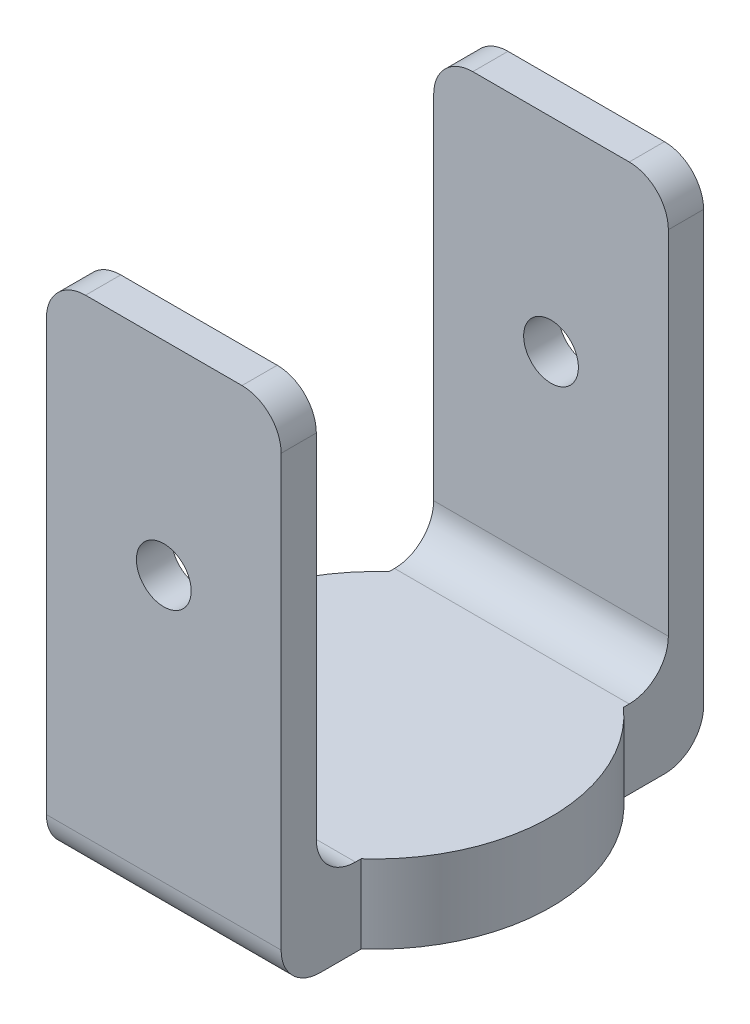
ISO-10303-21;
HEADER;
FILE_DESCRIPTION(('STEP AP214'),'2;1');
FILE_NAME('part.step','',(''),(''),'','','');
FILE_SCHEMA(('AUTOMOTIVE_DESIGN { 1 0 10303 214 1 1 1 1 }'));
ENDSEC;
DATA;
#1=APPLICATION_CONTEXT('core data for automotive mechanical design processes');
#2=APPLICATION_PROTOCOL_DEFINITION('international standard','automotive_design',2000,#1);
#3=PRODUCT_CONTEXT('',#1,'mechanical');
#4=PRODUCT('Part','Part','',(#3));
#5=PRODUCT_RELATED_PRODUCT_CATEGORY('part','',(#4));
#6=PRODUCT_DEFINITION_FORMATION('','',#4);
#7=PRODUCT_DEFINITION_CONTEXT('part definition',#1,'design');
#8=PRODUCT_DEFINITION('design','',#6,#7);
#9=PRODUCT_DEFINITION_SHAPE('','',#8);
#10=(LENGTH_UNIT() NAMED_UNIT(*) SI_UNIT(.MILLI.,.METRE.));
#11=(NAMED_UNIT(*) PLANE_ANGLE_UNIT() SI_UNIT($,.RADIAN.));
#12=(NAMED_UNIT(*) SI_UNIT($,.STERADIAN.) SOLID_ANGLE_UNIT());
#13=UNCERTAINTY_MEASURE_WITH_UNIT(LENGTH_MEASURE(1.E-05),#10,'distance_accuracy_value','');
#14=(GEOMETRIC_REPRESENTATION_CONTEXT(3) GLOBAL_UNCERTAINTY_ASSIGNED_CONTEXT((#13)) GLOBAL_UNIT_ASSIGNED_CONTEXT((#10,
#11,#12)) REPRESENTATION_CONTEXT('',''));
#15=CARTESIAN_POINT('',(0.,0.,0.));
#16=DIRECTION('',(0.,0.,1.));
#17=DIRECTION('',(1.,0.,0.));
#18=AXIS2_PLACEMENT_3D('',#15,#16,#17);
#19=CARTESIAN_POINT('',(30.,0.,0.));
#20=DIRECTION('',(1.,0.,0.));
#21=DIRECTION('',(0.,0.,-1.));
#22=AXIS2_PLACEMENT_3D('',#19,#20,#21);
#23=PLANE('',#22);
#24=DIRECTION('',(0.,1.,0.));
#25=VECTOR('',#24,1.);
#26=CARTESIAN_POINT('',(30.,-55.,-4.5));
#27=LINE('',#26,#25);
#28=CARTESIAN_POINT('',(30.,-50.,-4.5));
#29=VERTEX_POINT('',#28);
#30=CARTESIAN_POINT('',(30.,-5.,-4.5));
#31=VERTEX_POINT('',#30);
#32=EDGE_CURVE('E235',#29,#31,#27,.T.);
#33=ORIENTED_EDGE('',*,*,#32,.T.);
#34=DIRECTION('',(0.,0.,1.));
#35=VECTOR('',#34,1.);
#36=CARTESIAN_POINT('',(30.,-5.,0.));
#37=LINE('',#36,#35);
#38=CARTESIAN_POINT('',(30.,-5.,0.));
#39=VERTEX_POINT('',#38);
#40=EDGE_CURVE('E320',#31,#39,#37,.T.);
#41=ORIENTED_EDGE('',*,*,#40,.T.);
#42=DIRECTION('',(0.,-1.,0.));
#43=VECTOR('',#42,1.);
#44=CARTESIAN_POINT('',(30.,0.,0.));
#45=LINE('',#44,#43);
#46=CARTESIAN_POINT('',(30.,-60.,0.));
#47=VERTEX_POINT('',#46);
#48=EDGE_CURVE('E191',#39,#47,#45,.T.);
#49=ORIENTED_EDGE('',*,*,#48,.T.);
#50=CARTESIAN_POINT('',(30.,-60.,-5.00000000000001));
#51=DIRECTION('',(1.,0.,0.));
#52=DIRECTION('',(0.,0.,-1.));
#53=AXIS2_PLACEMENT_3D('',#50,#51,#52);
#54=CIRCLE('',#53,5.);
#55=CARTESIAN_POINT('',(30.,-65.,-5.00000000000001));
#56=VERTEX_POINT('',#55);
#57=EDGE_CURVE('E317',#47,#56,#54,.T.);
#58=ORIENTED_EDGE('',*,*,#57,.T.);
#59=DIRECTION('',(0.,0.,-1.));
#60=VECTOR('',#59,1.);
#61=CARTESIAN_POINT('',(30.,-65.,0.));
#62=LINE('',#61,#60);
#63=CARTESIAN_POINT('',(30.,-65.,-10.2294901687516));
#64=VERTEX_POINT('',#63);
#65=EDGE_CURVE('E190',#56,#64,#62,.T.);
#66=ORIENTED_EDGE('',*,*,#65,.T.);
#67=DIRECTION('',(0.,-1.,0.));
#68=VECTOR('',#67,1.);
#69=CARTESIAN_POINT('',(30.,-55.,-10.2294901687516));
#70=LINE('',#69,#68);
#71=CARTESIAN_POINT('',(30.,-55.,-10.2294901687516));
#72=VERTEX_POINT('',#71);
#73=EDGE_CURVE('E202',#72,#64,#70,.T.);
#74=ORIENTED_EDGE('',*,*,#73,.F.);
#75=DIRECTION('',(0.,0.,1.));
#76=VECTOR('',#75,1.);
#77=CARTESIAN_POINT('',(30.,-55.,-49.5));
#78=LINE('',#77,#76);
#79=CARTESIAN_POINT('',(30.,-55.,-9.5));
#80=VERTEX_POINT('',#79);
#81=EDGE_CURVE('E232',#72,#80,#78,.T.);
#82=ORIENTED_EDGE('',*,*,#81,.T.);
#83=CARTESIAN_POINT('',(30.,-50.,-9.5));
#84=DIRECTION('',(1.,0.,0.));
#85=DIRECTION('',(0.,0.,-1.));
#86=AXIS2_PLACEMENT_3D('',#83,#84,#85);
#87=CIRCLE('',#86,5.);
#88=EDGE_CURVE('E11',#80,#29,#87,.F.);
#89=ORIENTED_EDGE('',*,*,#88,.T.);
#90=EDGE_LOOP('',(#33,#41,#49,#58,#66,#74,#82,#89));
#91=FACE_BOUND('',#90,.T.);
#92=ADVANCED_FACE('F44',(#91),#23,.T.);
#93=CARTESIAN_POINT('',(0.,0.,0.));
#94=DIRECTION('',(1.,0.,0.));
#95=DIRECTION('',(0.,0.,-1.));
#96=AXIS2_PLACEMENT_3D('',#93,#94,#95);
#97=PLANE('',#96);
#98=DIRECTION('',(0.,-1.,0.));
#99=VECTOR('',#98,1.);
#100=CARTESIAN_POINT('',(0.,0.,0.));
#101=LINE('',#100,#99);
#102=CARTESIAN_POINT('',(0.,-5.,0.));
#103=VERTEX_POINT('',#102);
#104=CARTESIAN_POINT('',(0.,-60.,0.));
#105=VERTEX_POINT('',#104);
#106=EDGE_CURVE('E220',#103,#105,#101,.T.);
#107=ORIENTED_EDGE('',*,*,#106,.F.);
#108=DIRECTION('',(0.,0.,1.));
#109=VECTOR('',#108,1.);
#110=CARTESIAN_POINT('',(0.,-5.,0.));
#111=LINE('',#110,#109);
#112=CARTESIAN_POINT('',(0.,-5.,-4.5));
#113=VERTEX_POINT('',#112);
#114=EDGE_CURVE('E304',#103,#113,#111,.F.);
#115=ORIENTED_EDGE('',*,*,#114,.T.);
#116=DIRECTION('',(0.,1.,0.));
#117=VECTOR('',#116,1.);
#118=CARTESIAN_POINT('',(0.,-55.,-4.5));
#119=LINE('',#118,#117);
#120=CARTESIAN_POINT('',(0.,-50.,-4.5));
#121=VERTEX_POINT('',#120);
#122=EDGE_CURVE('E223',#121,#113,#119,.T.);
#123=ORIENTED_EDGE('',*,*,#122,.F.);
#124=CARTESIAN_POINT('',(0.,-50.,-9.5));
#125=DIRECTION('',(1.,0.,0.));
#126=DIRECTION('',(0.,0.,-1.));
#127=AXIS2_PLACEMENT_3D('',#124,#125,#126);
#128=CIRCLE('',#127,5.);
#129=CARTESIAN_POINT('',(0.,-55.,-9.5));
#130=VERTEX_POINT('',#129);
#131=EDGE_CURVE('E54',#121,#130,#128,.T.);
#132=ORIENTED_EDGE('',*,*,#131,.T.);
#133=DIRECTION('',(0.,0.,1.));
#134=VECTOR('',#133,1.);
#135=CARTESIAN_POINT('',(0.,-55.,-49.5));
#136=LINE('',#135,#134);
#137=CARTESIAN_POINT('',(0.,-55.,-10.2294901687516));
#138=VERTEX_POINT('',#137);
#139=EDGE_CURVE('E255',#138,#130,#136,.T.);
#140=ORIENTED_EDGE('',*,*,#139,.F.);
#141=DIRECTION('',(0.,-1.,0.));
#142=VECTOR('',#141,1.);
#143=CARTESIAN_POINT('',(0.,-55.,-10.2294901687516));
#144=LINE('',#143,#142);
#145=CARTESIAN_POINT('',(0.,-65.,-10.2294901687516));
#146=VERTEX_POINT('',#145);
#147=EDGE_CURVE('E281',#138,#146,#144,.T.);
#148=ORIENTED_EDGE('',*,*,#147,.T.);
#149=DIRECTION('',(0.,0.,-1.));
#150=VECTOR('',#149,1.);
#151=CARTESIAN_POINT('',(0.,-65.,0.));
#152=LINE('',#151,#150);
#153=CARTESIAN_POINT('',(0.,-65.,-5.00000000000001));
#154=VERTEX_POINT('',#153);
#155=EDGE_CURVE('E244',#154,#146,#152,.T.);
#156=ORIENTED_EDGE('',*,*,#155,.F.);
#157=CARTESIAN_POINT('',(0.,-60.,-5.00000000000001));
#158=DIRECTION('',(1.,0.,0.));
#159=DIRECTION('',(0.,0.,-1.));
#160=AXIS2_PLACEMENT_3D('',#157,#158,#159);
#161=CIRCLE('',#160,5.);
#162=EDGE_CURVE('E301',#154,#105,#161,.F.);
#163=ORIENTED_EDGE('',*,*,#162,.T.);
#164=EDGE_LOOP('',(#107,#115,#123,#132,#140,#148,#156,#163));
#165=FACE_BOUND('',#164,.T.);
#166=ADVANCED_FACE('F387',(#165),#97,.F.);
#167=CARTESIAN_POINT('',(30.,0.,-4.5));
#168=DIRECTION('',(0.,-1.,0.));
#169=DIRECTION('',(0.,0.,-1.));
#170=AXIS2_PLACEMENT_3D('',#167,#168,#169);
#171=PLANE('',#170);
#172=DIRECTION('',(-1.,0.,0.));
#173=VECTOR('',#172,1.);
#174=CARTESIAN_POINT('',(30.,0.,-4.5));
#175=LINE('',#174,#173);
#176=CARTESIAN_POINT('',(25.,0.,-4.5));
#177=VERTEX_POINT('',#176);
#178=CARTESIAN_POINT('',(5.,0.,-4.5));
#179=VERTEX_POINT('',#178);
#180=EDGE_CURVE('E239',#177,#179,#175,.T.);
#181=ORIENTED_EDGE('',*,*,#180,.T.);
#182=DIRECTION('',(0.,0.,1.));
#183=VECTOR('',#182,1.);
#184=CARTESIAN_POINT('',(5.,0.,-4.5));
#185=LINE('',#184,#183);
#186=CARTESIAN_POINT('',(5.,0.,0.));
#187=VERTEX_POINT('',#186);
#188=EDGE_CURVE('E288',#179,#187,#185,.T.);
#189=ORIENTED_EDGE('',*,*,#188,.T.);
#190=DIRECTION('',(-1.,0.,0.));
#191=VECTOR('',#190,1.);
#192=CARTESIAN_POINT('',(30.,0.,0.));
#193=LINE('',#192,#191);
#194=CARTESIAN_POINT('',(25.,0.,0.));
#195=VERTEX_POINT('',#194);
#196=EDGE_CURVE('E273',#195,#187,#193,.T.);
#197=ORIENTED_EDGE('',*,*,#196,.F.);
#198=DIRECTION('',(0.,0.,1.));
#199=VECTOR('',#198,1.);
#200=CARTESIAN_POINT('',(25.,0.,-4.5));
#201=LINE('',#200,#199);
#202=EDGE_CURVE('E285',#195,#177,#201,.F.);
#203=ORIENTED_EDGE('',*,*,#202,.T.);
#204=EDGE_LOOP('',(#181,#189,#197,#203));
#205=FACE_BOUND('',#204,.T.);
#206=ADVANCED_FACE('F471',(#205),#171,.F.);
#207=CARTESIAN_POINT('',(30.,0.,0.));
#208=DIRECTION('',(0.,0.,-1.));
#209=DIRECTION('',(0.,1.,0.));
#210=AXIS2_PLACEMENT_3D('',#207,#208,#209);
#211=PLANE('',#210);
#212=CARTESIAN_POINT('',(15.,-26.,0.));
#213=DIRECTION('',(0.,0.,-1.));
#214=DIRECTION('',(0.,1.,0.));
#215=AXIS2_PLACEMENT_3D('',#212,#213,#214);
#216=CIRCLE('',#215,3.5);
#217=CARTESIAN_POINT('',(15.,-22.5,0.));
#218=VERTEX_POINT('',#217);
#219=EDGE_CURVE('E215',#218,#218,#216,.T.);
#220=ORIENTED_EDGE('',*,*,#219,.T.);
#221=EDGE_LOOP('',(#220));
#222=FACE_BOUND('',#221,.T.);
#223=ORIENTED_EDGE('',*,*,#196,.T.);
#224=CARTESIAN_POINT('',(5.,-5.,0.));
#225=DIRECTION('',(0.,0.,-1.));
#226=DIRECTION('',(0.,1.,0.));
#227=AXIS2_PLACEMENT_3D('',#224,#225,#226);
#228=CIRCLE('',#227,5.);
#229=EDGE_CURVE('E298',#187,#103,#228,.F.);
#230=ORIENTED_EDGE('',*,*,#229,.T.);
#231=ORIENTED_EDGE('',*,*,#106,.T.);
#232=DIRECTION('',(-1.,0.,0.));
#233=VECTOR('',#232,1.);
#234=CARTESIAN_POINT('',(30.,-60.,0.));
#235=LINE('',#234,#233);
#236=EDGE_CURVE('E292',#105,#47,#235,.F.);
#237=ORIENTED_EDGE('',*,*,#236,.T.);
#238=ORIENTED_EDGE('',*,*,#48,.F.);
#239=CARTESIAN_POINT('',(25.,-5.,0.));
#240=DIRECTION('',(0.,0.,-1.));
#241=DIRECTION('',(0.,1.,0.));
#242=AXIS2_PLACEMENT_3D('',#239,#240,#241);
#243=CIRCLE('',#242,5.);
#244=EDGE_CURVE('E295',#39,#195,#243,.F.);
#245=ORIENTED_EDGE('',*,*,#244,.T.);
#246=EDGE_LOOP('',(#223,#230,#231,#237,#238,#245));
#247=FACE_BOUND('',#246,.T.);
#248=ADVANCED_FACE('F412',(#222,#247),#211,.F.);
#249=CARTESIAN_POINT('',(30.,-65.,0.));
#250=DIRECTION('',(0.,1.,0.));
#251=DIRECTION('',(0.,0.,1.));
#252=AXIS2_PLACEMENT_3D('',#249,#250,#251);
#253=PLANE('',#252);
#254=CARTESIAN_POINT('',(0.,-65.,-43.7705098312485));
#255=VERTEX_POINT('',#254);
#256=CARTESIAN_POINT('',(0.,-65.,-49.));
#257=VERTEX_POINT('',#256);
#258=EDGE_CURVE('E243',#255,#257,#152,.T.);
#259=ORIENTED_EDGE('',*,*,#258,.T.);
#260=DIRECTION('',(-1.,0.,0.));
#261=VECTOR('',#260,1.);
#262=CARTESIAN_POINT('',(30.,-65.,-49.));
#263=LINE('',#262,#261);
#264=CARTESIAN_POINT('',(30.,-65.,-49.));
#265=VERTEX_POINT('',#264);
#266=EDGE_CURVE('E69',#257,#265,#263,.F.);
#267=ORIENTED_EDGE('',*,*,#266,.T.);
#268=CARTESIAN_POINT('',(30.,-65.,-43.7705098312485));
#269=VERTEX_POINT('',#268);
#270=EDGE_CURVE('E182',#269,#265,#62,.T.);
#271=ORIENTED_EDGE('',*,*,#270,.F.);
#272=CARTESIAN_POINT('',(15.,-65.,-27.));
#273=DIRECTION('',(0.,-1.,0.));
#274=DIRECTION('',(0.,0.,-1.));
#275=AXIS2_PLACEMENT_3D('',#272,#273,#274);
#276=CIRCLE('',#275,22.5);
#277=EDGE_CURVE('E187',#269,#64,#276,.T.);
#278=ORIENTED_EDGE('',*,*,#277,.T.);
#279=ORIENTED_EDGE('',*,*,#65,.F.);
#280=DIRECTION('',(-1.,0.,0.));
#281=VECTOR('',#280,1.);
#282=CARTESIAN_POINT('',(30.,-65.,-5.00000000000001));
#283=LINE('',#282,#281);
#284=EDGE_CURVE('E370',#56,#154,#283,.T.);
#285=ORIENTED_EDGE('',*,*,#284,.T.);
#286=ORIENTED_EDGE('',*,*,#155,.T.);
#287=EDGE_CURVE('E209',#146,#255,#276,.T.);
#288=ORIENTED_EDGE('',*,*,#287,.T.);
#289=EDGE_LOOP('',(#259,#267,#271,#278,#279,#285,#286,#288));
#290=FACE_BOUND('',#289,.T.);
#291=ADVANCED_FACE('F184',(#290),#253,.F.);
#292=CARTESIAN_POINT('',(30.,-65.,-54.));
#293=DIRECTION('',(0.,0.,1.));
#294=DIRECTION('',(1.,0.,0.));
#295=AXIS2_PLACEMENT_3D('',#292,#293,#294);
#296=PLANE('',#295);
#297=CARTESIAN_POINT('',(15.,-26.,-54.));
#298=DIRECTION('',(0.,0.,-1.));
#299=DIRECTION('',(-1.,0.,0.));
#300=AXIS2_PLACEMENT_3D('',#297,#298,#299);
#301=CIRCLE('',#300,3.5);
#302=CARTESIAN_POINT('',(11.5,-26.,-54.));
#303=VERTEX_POINT('',#302);
#304=EDGE_CURVE('E490',#303,#303,#301,.T.);
#305=ORIENTED_EDGE('',*,*,#304,.F.);
#306=EDGE_LOOP('',(#305));
#307=FACE_BOUND('',#306,.T.);
#308=DIRECTION('',(0.,1.,0.));
#309=VECTOR('',#308,1.);
#310=CARTESIAN_POINT('',(0.,-65.,-54.));
#311=LINE('',#310,#309);
#312=CARTESIAN_POINT('',(0.,-60.,-54.));
#313=VERTEX_POINT('',#312);
#314=CARTESIAN_POINT('',(0.,-4.99999999999999,-54.));
#315=VERTEX_POINT('',#314);
#316=EDGE_CURVE('E247',#313,#315,#311,.T.);
#317=ORIENTED_EDGE('',*,*,#316,.T.);
#318=CARTESIAN_POINT('',(5.,-4.99999999999999,-54.));
#319=DIRECTION('',(0.,0.,1.));
#320=DIRECTION('',(1.,0.,0.));
#321=AXIS2_PLACEMENT_3D('',#318,#319,#320);
#322=CIRCLE('',#321,5.);
#323=CARTESIAN_POINT('',(5.,0.,-54.));
#324=VERTEX_POINT('',#323);
#325=EDGE_CURVE('E353',#315,#324,#322,.F.);
#326=ORIENTED_EDGE('',*,*,#325,.T.);
#327=DIRECTION('',(-1.,0.,0.));
#328=VECTOR('',#327,1.);
#329=CARTESIAN_POINT('',(30.,0.,-54.));
#330=LINE('',#329,#328);
#331=CARTESIAN_POINT('',(25.,0.,-54.));
#332=VERTEX_POINT('',#331);
#333=EDGE_CURVE('E269',#332,#324,#330,.T.);
#334=ORIENTED_EDGE('',*,*,#333,.F.);
#335=CARTESIAN_POINT('',(25.,-4.99999999999999,-54.));
#336=DIRECTION('',(0.,0.,1.));
#337=DIRECTION('',(1.,0.,0.));
#338=AXIS2_PLACEMENT_3D('',#335,#336,#337);
#339=CIRCLE('',#338,5.);
#340=CARTESIAN_POINT('',(30.,-4.99999999999999,-54.));
#341=VERTEX_POINT('',#340);
#342=EDGE_CURVE('E350',#332,#341,#339,.F.);
#343=ORIENTED_EDGE('',*,*,#342,.T.);
#344=DIRECTION('',(0.,1.,0.));
#345=VECTOR('',#344,1.);
#346=CARTESIAN_POINT('',(30.,-65.,-54.));
#347=LINE('',#346,#345);
#348=CARTESIAN_POINT('',(30.,-60.,-54.));
#349=VERTEX_POINT('',#348);
#350=EDGE_CURVE('E226',#349,#341,#347,.T.);
#351=ORIENTED_EDGE('',*,*,#350,.F.);
#352=DIRECTION('',(-1.,0.,0.));
#353=VECTOR('',#352,1.);
#354=CARTESIAN_POINT('',(30.,-60.,-54.));
#355=LINE('',#354,#353);
#356=EDGE_CURVE('E346',#349,#313,#355,.T.);
#357=ORIENTED_EDGE('',*,*,#356,.T.);
#358=EDGE_LOOP('',(#317,#326,#334,#343,#351,#357));
#359=FACE_BOUND('',#358,.T.);
#360=ADVANCED_FACE('F431',(#307,#359),#296,.F.);
#361=CARTESIAN_POINT('',(30.,0.,-54.));
#362=DIRECTION('',(0.,-1.,0.));
#363=DIRECTION('',(0.,0.,-1.));
#364=AXIS2_PLACEMENT_3D('',#361,#362,#363);
#365=PLANE('',#364);
#366=ORIENTED_EDGE('',*,*,#333,.T.);
#367=DIRECTION('',(0.,0.,1.));
#368=VECTOR('',#367,1.);
#369=CARTESIAN_POINT('',(5.,0.,-54.));
#370=LINE('',#369,#368);
#371=CARTESIAN_POINT('',(5.,0.,-49.5));
#372=VERTEX_POINT('',#371);
#373=EDGE_CURVE('E327',#324,#372,#370,.T.);
#374=ORIENTED_EDGE('',*,*,#373,.T.);
#375=DIRECTION('',(-1.,0.,0.));
#376=VECTOR('',#375,1.);
#377=CARTESIAN_POINT('',(30.,0.,-49.5));
#378=LINE('',#377,#376);
#379=CARTESIAN_POINT('',(25.,0.,-49.5));
#380=VERTEX_POINT('',#379);
#381=EDGE_CURVE('E265',#380,#372,#378,.T.);
#382=ORIENTED_EDGE('',*,*,#381,.F.);
#383=DIRECTION('',(0.,0.,1.));
#384=VECTOR('',#383,1.);
#385=CARTESIAN_POINT('',(25.,0.,-54.));
#386=LINE('',#385,#384);
#387=EDGE_CURVE('E324',#380,#332,#386,.F.);
#388=ORIENTED_EDGE('',*,*,#387,.T.);
#389=EDGE_LOOP('',(#366,#374,#382,#388));
#390=FACE_BOUND('',#389,.T.);
#391=ADVANCED_FACE('F455',(#390),#365,.F.);
#392=CARTESIAN_POINT('',(30.,0.,-49.5));
#393=DIRECTION('',(0.,0.,-1.));
#394=DIRECTION('',(0.,1.,0.));
#395=AXIS2_PLACEMENT_3D('',#392,#393,#394);
#396=PLANE('',#395);
#397=CARTESIAN_POINT('',(15.,-26.,-49.5));
#398=DIRECTION('',(0.,0.,-1.));
#399=DIRECTION('',(0.,1.,0.));
#400=AXIS2_PLACEMENT_3D('',#397,#398,#399);
#401=CIRCLE('',#400,3.5);
#402=CARTESIAN_POINT('',(15.,-22.5,-49.5));
#403=VERTEX_POINT('',#402);
#404=EDGE_CURVE('E489',#403,#403,#401,.T.);
#405=ORIENTED_EDGE('',*,*,#404,.T.);
#406=EDGE_LOOP('',(#405));
#407=FACE_BOUND('',#406,.T.);
#408=ORIENTED_EDGE('',*,*,#381,.T.);
#409=CARTESIAN_POINT('',(5.,-5.,-49.5));
#410=DIRECTION('',(0.,0.,-1.));
#411=DIRECTION('',(0.,1.,0.));
#412=AXIS2_PLACEMENT_3D('',#409,#410,#411);
#413=CIRCLE('',#412,5.);
#414=CARTESIAN_POINT('',(0.,-5.,-49.5));
#415=VERTEX_POINT('',#414);
#416=EDGE_CURVE('E337',#372,#415,#413,.F.);
#417=ORIENTED_EDGE('',*,*,#416,.T.);
#418=DIRECTION('',(0.,-1.,0.));
#419=VECTOR('',#418,1.);
#420=CARTESIAN_POINT('',(0.,0.,-49.5));
#421=LINE('',#420,#419);
#422=CARTESIAN_POINT('',(0.,-50.,-49.5));
#423=VERTEX_POINT('',#422);
#424=EDGE_CURVE('E251',#415,#423,#421,.T.);
#425=ORIENTED_EDGE('',*,*,#424,.T.);
#426=DIRECTION('',(-1.,0.,0.));
#427=VECTOR('',#426,1.);
#428=CARTESIAN_POINT('',(30.,-50.,-49.5));
#429=LINE('',#428,#427);
#430=CARTESIAN_POINT('',(30.,-50.,-49.5));
#431=VERTEX_POINT('',#430);
#432=EDGE_CURVE('E331',#423,#431,#429,.F.);
#433=ORIENTED_EDGE('',*,*,#432,.T.);
#434=DIRECTION('',(0.,-1.,0.));
#435=VECTOR('',#434,1.);
#436=CARTESIAN_POINT('',(30.,0.,-49.5));
#437=LINE('',#436,#435);
#438=CARTESIAN_POINT('',(30.,-5.,-49.5));
#439=VERTEX_POINT('',#438);
#440=EDGE_CURVE('E229',#439,#431,#437,.T.);
#441=ORIENTED_EDGE('',*,*,#440,.F.);
#442=CARTESIAN_POINT('',(25.,-5.,-49.5));
#443=DIRECTION('',(0.,0.,-1.));
#444=DIRECTION('',(0.,1.,0.));
#445=AXIS2_PLACEMENT_3D('',#442,#443,#444);
#446=CIRCLE('',#445,5.);
#447=EDGE_CURVE('E334',#439,#380,#446,.F.);
#448=ORIENTED_EDGE('',*,*,#447,.T.);
#449=EDGE_LOOP('',(#408,#417,#425,#433,#441,#448));
#450=FACE_BOUND('',#449,.T.);
#451=ADVANCED_FACE('F440',(#407,#450),#396,.F.);
#452=CARTESIAN_POINT('',(30.,-55.,-49.5));
#453=DIRECTION('',(0.,-1.,0.));
#454=DIRECTION('',(0.,0.,-1.));
#455=AXIS2_PLACEMENT_3D('',#452,#453,#454);
#456=PLANE('',#455);
#457=CARTESIAN_POINT('',(30.,-55.,-44.5));
#458=VERTEX_POINT('',#457);
#459=CARTESIAN_POINT('',(30.,-55.,-43.7705098312485));
#460=VERTEX_POINT('',#459);
#461=EDGE_CURVE('E197',#458,#460,#78,.T.);
#462=ORIENTED_EDGE('',*,*,#461,.F.);
#463=DIRECTION('',(-1.,0.,0.));
#464=VECTOR('',#463,1.);
#465=CARTESIAN_POINT('',(0.,-55.,-44.5));
#466=LINE('',#465,#464);
#467=CARTESIAN_POINT('',(0.,-55.,-44.5));
#468=VERTEX_POINT('',#467);
#469=EDGE_CURVE('E366',#458,#468,#466,.T.);
#470=ORIENTED_EDGE('',*,*,#469,.T.);
#471=CARTESIAN_POINT('',(0.,-55.,-43.7705098312485));
#472=VERTEX_POINT('',#471);
#473=EDGE_CURVE('E256',#468,#472,#136,.T.);
#474=ORIENTED_EDGE('',*,*,#473,.T.);
#475=CARTESIAN_POINT('',(15.,-55.,-27.));
#476=DIRECTION('',(0.,-1.,0.));
#477=DIRECTION('',(0.,0.,-1.));
#478=AXIS2_PLACEMENT_3D('',#475,#476,#477);
#479=CIRCLE('',#478,22.5);
#480=EDGE_CURVE('E208',#138,#472,#479,.T.);
#481=ORIENTED_EDGE('',*,*,#480,.F.);
#482=ORIENTED_EDGE('',*,*,#139,.T.);
#483=DIRECTION('',(-1.,0.,0.));
#484=VECTOR('',#483,1.);
#485=CARTESIAN_POINT('',(30.,-55.,-9.5));
#486=LINE('',#485,#484);
#487=EDGE_CURVE('E363',#130,#80,#486,.F.);
#488=ORIENTED_EDGE('',*,*,#487,.T.);
#489=ORIENTED_EDGE('',*,*,#81,.F.);
#490=EDGE_CURVE('E203',#460,#72,#479,.T.);
#491=ORIENTED_EDGE('',*,*,#490,.F.);
#492=EDGE_LOOP('',(#462,#470,#474,#481,#482,#488,#489,#491));
#493=FACE_BOUND('',#492,.T.);
#494=ADVANCED_FACE('F393',(#493),#456,.F.);
#495=CARTESIAN_POINT('',(30.,-55.,-4.5));
#496=DIRECTION('',(0.,0.,1.));
#497=DIRECTION('',(1.,0.,0.));
#498=AXIS2_PLACEMENT_3D('',#495,#496,#497);
#499=PLANE('',#498);
#500=CARTESIAN_POINT('',(15.,-26.,-4.5));
#501=DIRECTION('',(0.,0.,1.));
#502=DIRECTION('',(1.,0.,0.));
#503=AXIS2_PLACEMENT_3D('',#500,#501,#502);
#504=CIRCLE('',#503,3.5);
#505=CARTESIAN_POINT('',(18.5,-26.,-4.5));
#506=VERTEX_POINT('',#505);
#507=EDGE_CURVE('E48',#506,#506,#504,.T.);
#508=ORIENTED_EDGE('',*,*,#507,.T.);
#509=EDGE_LOOP('',(#508));
#510=FACE_BOUND('',#509,.T.);
#511=ORIENTED_EDGE('',*,*,#122,.T.);
#512=CARTESIAN_POINT('',(5.,-5.,-4.5));
#513=DIRECTION('',(0.,0.,1.));
#514=DIRECTION('',(1.,0.,0.));
#515=AXIS2_PLACEMENT_3D('',#512,#513,#514);
#516=CIRCLE('',#515,5.);
#517=EDGE_CURVE('E314',#113,#179,#516,.F.);
#518=ORIENTED_EDGE('',*,*,#517,.T.);
#519=ORIENTED_EDGE('',*,*,#180,.F.);
#520=CARTESIAN_POINT('',(25.,-5.,-4.5));
#521=DIRECTION('',(0.,0.,1.));
#522=DIRECTION('',(1.,0.,0.));
#523=AXIS2_PLACEMENT_3D('',#520,#521,#522);
#524=CIRCLE('',#523,5.);
#525=EDGE_CURVE('E311',#177,#31,#524,.F.);
#526=ORIENTED_EDGE('',*,*,#525,.T.);
#527=ORIENTED_EDGE('',*,*,#32,.F.);
#528=DIRECTION('',(-1.,0.,0.));
#529=VECTOR('',#528,1.);
#530=CARTESIAN_POINT('',(0.,-50.,-4.5));
#531=LINE('',#530,#529);
#532=EDGE_CURVE('E307',#29,#121,#531,.T.);
#533=ORIENTED_EDGE('',*,*,#532,.T.);
#534=EDGE_LOOP('',(#511,#518,#519,#526,#527,#533));
#535=FACE_BOUND('',#534,.T.);
#536=ADVANCED_FACE('F403',(#510,#535),#499,.F.);
#537=ORIENTED_EDGE('',*,*,#350,.T.);
#538=DIRECTION('',(0.,0.,1.));
#539=VECTOR('',#538,1.);
#540=CARTESIAN_POINT('',(30.,-5.,-49.5));
#541=LINE('',#540,#539);
#542=EDGE_CURVE('E359',#341,#439,#541,.T.);
#543=ORIENTED_EDGE('',*,*,#542,.T.);
#544=ORIENTED_EDGE('',*,*,#440,.T.);
#545=CARTESIAN_POINT('',(30.,-50.,-44.5));
#546=DIRECTION('',(1.,0.,0.));
#547=DIRECTION('',(0.,0.,-1.));
#548=AXIS2_PLACEMENT_3D('',#545,#546,#547);
#549=CIRCLE('',#548,5.);
#550=EDGE_CURVE('E61',#431,#458,#549,.F.);
#551=ORIENTED_EDGE('',*,*,#550,.T.);
#552=ORIENTED_EDGE('',*,*,#461,.T.);
#553=DIRECTION('',(0.,-1.,0.));
#554=VECTOR('',#553,1.);
#555=CARTESIAN_POINT('',(30.,-55.,-43.7705098312485));
#556=LINE('',#555,#554);
#557=EDGE_CURVE('E194',#269,#460,#556,.F.);
#558=ORIENTED_EDGE('',*,*,#557,.F.);
#559=ORIENTED_EDGE('',*,*,#270,.T.);
#560=CARTESIAN_POINT('',(30.,-60.,-49.));
#561=DIRECTION('',(1.,0.,0.));
#562=DIRECTION('',(0.,0.,-1.));
#563=AXIS2_PLACEMENT_3D('',#560,#561,#562);
#564=CIRCLE('',#563,5.);
#565=EDGE_CURVE('E356',#265,#349,#564,.T.);
#566=ORIENTED_EDGE('',*,*,#565,.T.);
#567=EDGE_LOOP('',(#537,#543,#544,#551,#552,#558,#559,#566));
#568=FACE_BOUND('',#567,.T.);
#569=ADVANCED_FACE('F196',(#568),#23,.T.);
#570=ORIENTED_EDGE('',*,*,#424,.F.);
#571=DIRECTION('',(0.,0.,1.));
#572=VECTOR('',#571,1.);
#573=CARTESIAN_POINT('',(0.,-5.0000000000001,0.));
#574=LINE('',#573,#572);
#575=EDGE_CURVE('E343',#415,#315,#574,.F.);
#576=ORIENTED_EDGE('',*,*,#575,.T.);
#577=ORIENTED_EDGE('',*,*,#316,.F.);
#578=CARTESIAN_POINT('',(0.,-60.,-49.));
#579=DIRECTION('',(1.,0.,0.));
#580=DIRECTION('',(0.,0.,-1.));
#581=AXIS2_PLACEMENT_3D('',#578,#579,#580);
#582=CIRCLE('',#581,5.);
#583=EDGE_CURVE('E340',#313,#257,#582,.F.);
#584=ORIENTED_EDGE('',*,*,#583,.T.);
#585=ORIENTED_EDGE('',*,*,#258,.F.);
#586=DIRECTION('',(0.,-1.,0.));
#587=VECTOR('',#586,1.);
#588=CARTESIAN_POINT('',(0.,-55.,-43.7705098312485));
#589=LINE('',#588,#587);
#590=EDGE_CURVE('E277',#255,#472,#589,.F.);
#591=ORIENTED_EDGE('',*,*,#590,.T.);
#592=ORIENTED_EDGE('',*,*,#473,.F.);
#593=CARTESIAN_POINT('',(0.,-50.,-44.5));
#594=DIRECTION('',(1.,0.,0.));
#595=DIRECTION('',(0.,0.,-1.));
#596=AXIS2_PLACEMENT_3D('',#593,#594,#595);
#597=CIRCLE('',#596,5.);
#598=EDGE_CURVE('E376',#468,#423,#597,.T.);
#599=ORIENTED_EDGE('',*,*,#598,.T.);
#600=EDGE_LOOP('',(#570,#576,#577,#584,#585,#591,#592,#599));
#601=FACE_BOUND('',#600,.T.);
#602=ADVANCED_FACE('F448',(#601),#97,.F.);
#603=CARTESIAN_POINT('',(15.,-55.,-27.));
#604=DIRECTION('',(0.,-1.,0.));
#605=DIRECTION('',(0.,0.,-1.));
#606=AXIS2_PLACEMENT_3D('',#603,#604,#605);
#607=CYLINDRICAL_SURFACE('',#606,22.5);
#608=ORIENTED_EDGE('',*,*,#147,.F.);
#609=ORIENTED_EDGE('',*,*,#480,.T.);
#610=ORIENTED_EDGE('',*,*,#590,.F.);
#611=ORIENTED_EDGE('',*,*,#287,.F.);
#612=EDGE_LOOP('',(#608,#609,#610,#611));
#613=FACE_BOUND('',#612,.T.);
#614=ADVANCED_FACE('F420',(#613),#607,.T.);
#615=ORIENTED_EDGE('',*,*,#490,.T.);
#616=ORIENTED_EDGE('',*,*,#73,.T.);
#617=ORIENTED_EDGE('',*,*,#277,.F.);
#618=ORIENTED_EDGE('',*,*,#557,.T.);
#619=EDGE_LOOP('',(#615,#616,#617,#618));
#620=FACE_BOUND('',#619,.T.);
#621=ADVANCED_FACE('F206',(#620),#607,.T.);
#622=CARTESIAN_POINT('',(5.,-5.,-4.5));
#623=DIRECTION('',(0.,0.,1.));
#624=DIRECTION('',(0.,-1.,0.));
#625=AXIS2_PLACEMENT_3D('',#622,#623,#624);
#626=CYLINDRICAL_SURFACE('',#625,5.);
#627=ORIENTED_EDGE('',*,*,#517,.F.);
#628=ORIENTED_EDGE('',*,*,#114,.F.);
#629=ORIENTED_EDGE('',*,*,#229,.F.);
#630=ORIENTED_EDGE('',*,*,#188,.F.);
#631=EDGE_LOOP('',(#627,#628,#629,#630));
#632=FACE_BOUND('',#631,.T.);
#633=ADVANCED_FACE('F513',(#632),#626,.T.);
#634=CARTESIAN_POINT('',(25.,-5.,0.));
#635=DIRECTION('',(0.,0.,-1.));
#636=DIRECTION('',(0.,1.,0.));
#637=AXIS2_PLACEMENT_3D('',#634,#635,#636);
#638=CYLINDRICAL_SURFACE('',#637,5.);
#639=ORIENTED_EDGE('',*,*,#525,.F.);
#640=ORIENTED_EDGE('',*,*,#202,.F.);
#641=ORIENTED_EDGE('',*,*,#244,.F.);
#642=ORIENTED_EDGE('',*,*,#40,.F.);
#643=EDGE_LOOP('',(#639,#640,#641,#642));
#644=FACE_BOUND('',#643,.T.);
#645=ADVANCED_FACE('F408',(#644),#638,.T.);
#646=CARTESIAN_POINT('',(5.,-4.99999999999999,-54.));
#647=DIRECTION('',(0.,0.,1.));
#648=DIRECTION('',(0.,-1.,0.));
#649=AXIS2_PLACEMENT_3D('',#646,#647,#648);
#650=CYLINDRICAL_SURFACE('',#649,5.);
#651=ORIENTED_EDGE('',*,*,#325,.F.);
#652=ORIENTED_EDGE('',*,*,#575,.F.);
#653=ORIENTED_EDGE('',*,*,#416,.F.);
#654=ORIENTED_EDGE('',*,*,#373,.F.);
#655=EDGE_LOOP('',(#651,#652,#653,#654));
#656=FACE_BOUND('',#655,.T.);
#657=ADVANCED_FACE('F452',(#656),#650,.T.);
#658=CARTESIAN_POINT('',(25.,-5.0000000000001,0.));
#659=DIRECTION('',(0.,0.,-1.));
#660=DIRECTION('',(0.,1.,0.));
#661=AXIS2_PLACEMENT_3D('',#658,#659,#660);
#662=CYLINDRICAL_SURFACE('',#661,5.);
#663=ORIENTED_EDGE('',*,*,#342,.F.);
#664=ORIENTED_EDGE('',*,*,#387,.F.);
#665=ORIENTED_EDGE('',*,*,#447,.F.);
#666=ORIENTED_EDGE('',*,*,#542,.F.);
#667=EDGE_LOOP('',(#663,#664,#665,#666));
#668=FACE_BOUND('',#667,.T.);
#669=ADVANCED_FACE('F437',(#668),#662,.T.);
#670=CARTESIAN_POINT('',(30.,-50.,-44.5));
#671=DIRECTION('',(1.,0.,0.));
#672=DIRECTION('',(0.,0.,-1.));
#673=AXIS2_PLACEMENT_3D('',#670,#671,#672);
#674=CYLINDRICAL_SURFACE('',#673,5.);
#675=ORIENTED_EDGE('',*,*,#550,.F.);
#676=ORIENTED_EDGE('',*,*,#432,.F.);
#677=ORIENTED_EDGE('',*,*,#598,.F.);
#678=ORIENTED_EDGE('',*,*,#469,.F.);
#679=EDGE_LOOP('',(#675,#676,#677,#678));
#680=FACE_BOUND('',#679,.T.);
#681=ADVANCED_FACE('F445',(#680),#674,.F.);
#682=CARTESIAN_POINT('',(30.,-50.,-9.5));
#683=DIRECTION('',(1.,0.,0.));
#684=DIRECTION('',(0.,0.,-1.));
#685=AXIS2_PLACEMENT_3D('',#682,#683,#684);
#686=CYLINDRICAL_SURFACE('',#685,5.);
#687=ORIENTED_EDGE('',*,*,#88,.F.);
#688=ORIENTED_EDGE('',*,*,#487,.F.);
#689=ORIENTED_EDGE('',*,*,#131,.F.);
#690=ORIENTED_EDGE('',*,*,#532,.F.);
#691=EDGE_LOOP('',(#687,#688,#689,#690));
#692=FACE_BOUND('',#691,.T.);
#693=ADVANCED_FACE('F398',(#692),#686,.F.);
#694=CARTESIAN_POINT('',(30.,-60.,-49.));
#695=DIRECTION('',(-1.,0.,0.));
#696=DIRECTION('',(0.,0.,1.));
#697=AXIS2_PLACEMENT_3D('',#694,#695,#696);
#698=CYLINDRICAL_SURFACE('',#697,5.);
#699=ORIENTED_EDGE('',*,*,#565,.F.);
#700=ORIENTED_EDGE('',*,*,#266,.F.);
#701=ORIENTED_EDGE('',*,*,#583,.F.);
#702=ORIENTED_EDGE('',*,*,#356,.F.);
#703=EDGE_LOOP('',(#699,#700,#701,#702));
#704=FACE_BOUND('',#703,.T.);
#705=ADVANCED_FACE('F426',(#704),#698,.T.);
#706=CARTESIAN_POINT('',(30.,-60.,-5.00000000000001));
#707=DIRECTION('',(-1.,0.,0.));
#708=DIRECTION('',(0.,0.,1.));
#709=AXIS2_PLACEMENT_3D('',#706,#707,#708);
#710=CYLINDRICAL_SURFACE('',#709,5.);
#711=ORIENTED_EDGE('',*,*,#57,.F.);
#712=ORIENTED_EDGE('',*,*,#236,.F.);
#713=ORIENTED_EDGE('',*,*,#162,.F.);
#714=ORIENTED_EDGE('',*,*,#284,.F.);
#715=EDGE_LOOP('',(#711,#712,#713,#714));
#716=FACE_BOUND('',#715,.T.);
#717=ADVANCED_FACE('F46',(#716),#710,.T.);
#718=CARTESIAN_POINT('',(15.,-26.,16.));
#719=DIRECTION('',(0.,0.,-1.));
#720=DIRECTION('',(-1.,0.,0.));
#721=AXIS2_PLACEMENT_3D('',#718,#719,#720);
#722=CYLINDRICAL_SURFACE('',#721,3.5);
#723=ORIENTED_EDGE('',*,*,#507,.F.);
#724=EDGE_LOOP('',(#723));
#725=FACE_BOUND('',#724,.T.);
#726=ORIENTED_EDGE('',*,*,#219,.F.);
#727=EDGE_LOOP('',(#726));
#728=FACE_BOUND('',#727,.T.);
#729=ADVANCED_FACE('F504',(#725,#728),#722,.F.);
#730=ORIENTED_EDGE('',*,*,#304,.T.);
#731=EDGE_LOOP('',(#730));
#732=FACE_BOUND('',#731,.T.);
#733=ORIENTED_EDGE('',*,*,#404,.F.);
#734=EDGE_LOOP('',(#733));
#735=FACE_BOUND('',#734,.T.);
#736=ADVANCED_FACE('F506',(#732,#735),#722,.F.);
#737=CLOSED_SHELL('',(#92,#166,#206,#248,#291,#360,#391,#451,#494,#536,#569,#602,#614,#621,#633,
#645,#657,#669,#681,#693,#705,#717,#729,#736));
#738=MANIFOLD_SOLID_BREP('B2',#737);
#739=ADVANCED_BREP_SHAPE_REPRESENTATION('',(#18,#738),#14);
#740=SHAPE_DEFINITION_REPRESENTATION(#9,#739);
ENDSEC;
END-ISO-10303-21;
